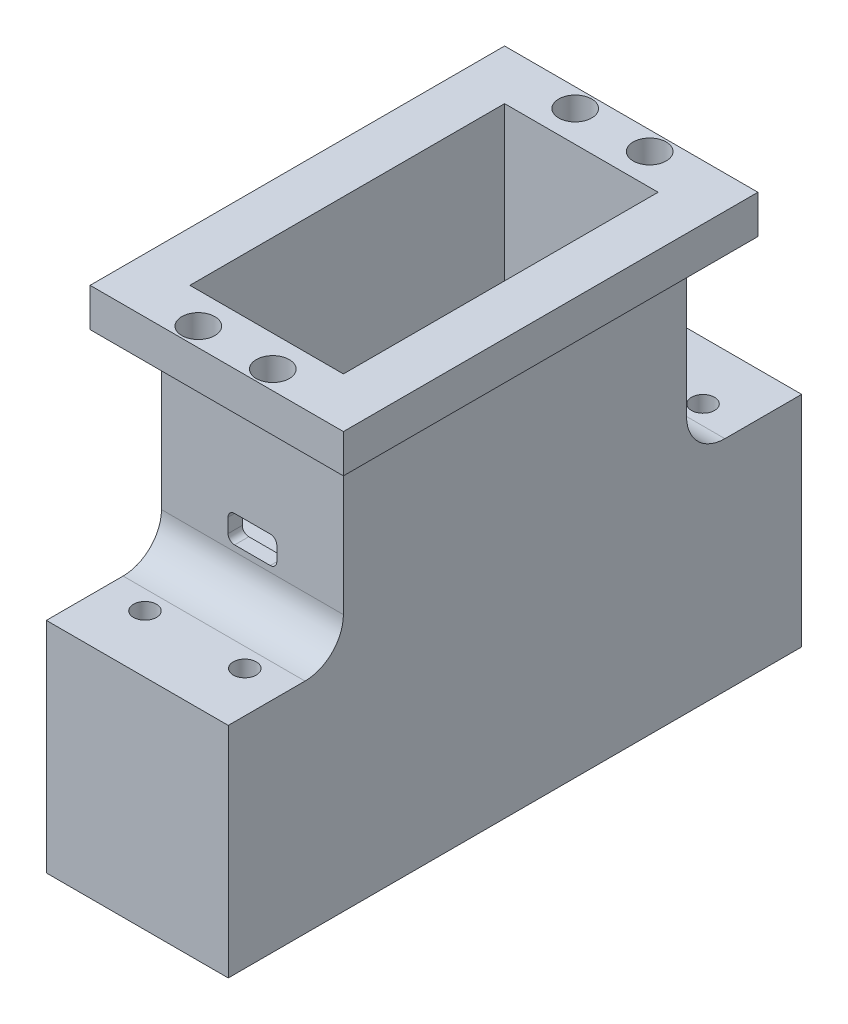
ISO-10303-21;
HEADER;
FILE_DESCRIPTION(('STEP AP214'),'2;1');
FILE_NAME('part.step','',(''),(''),'','','');
FILE_SCHEMA(('AUTOMOTIVE_DESIGN { 1 0 10303 214 1 1 1 1 }'));
ENDSEC;
DATA;
#1=APPLICATION_CONTEXT('core data for automotive mechanical design processes');
#2=APPLICATION_PROTOCOL_DEFINITION('international standard','automotive_design',2000,#1);
#3=PRODUCT_CONTEXT('',#1,'mechanical');
#4=PRODUCT('Part','Part','',(#3));
#5=PRODUCT_RELATED_PRODUCT_CATEGORY('part','',(#4));
#6=PRODUCT_DEFINITION_FORMATION('','',#4);
#7=PRODUCT_DEFINITION_CONTEXT('part definition',#1,'design');
#8=PRODUCT_DEFINITION('design','',#6,#7);
#9=PRODUCT_DEFINITION_SHAPE('','',#8);
#10=(LENGTH_UNIT() NAMED_UNIT(*) SI_UNIT(.MILLI.,.METRE.));
#11=(NAMED_UNIT(*) PLANE_ANGLE_UNIT() SI_UNIT($,.RADIAN.));
#12=(NAMED_UNIT(*) SI_UNIT($,.STERADIAN.) SOLID_ANGLE_UNIT());
#13=UNCERTAINTY_MEASURE_WITH_UNIT(LENGTH_MEASURE(1.E-05),#10,'distance_accuracy_value','');
#14=(GEOMETRIC_REPRESENTATION_CONTEXT(3) GLOBAL_UNCERTAINTY_ASSIGNED_CONTEXT((#13)) GLOBAL_UNIT_ASSIGNED_CONTEXT((#10,
#11,#12)) REPRESENTATION_CONTEXT('',''));
#15=CARTESIAN_POINT('',(0.,0.,0.));
#16=DIRECTION('',(0.,0.,1.));
#17=DIRECTION('',(1.,0.,0.));
#18=AXIS2_PLACEMENT_3D('',#15,#16,#17);
#19=CARTESIAN_POINT('',(0.,30.3,-20.5));
#20=DIRECTION('',(0.,0.,-1.));
#21=DIRECTION('',(-1.,0.,0.));
#22=AXIS2_PLACEMENT_3D('',#19,#20,#21);
#23=PLANE('',#22);
#24=DIRECTION('',(0.,-1.,0.));
#25=VECTOR('',#24,1.);
#26=CARTESIAN_POINT('',(-10.,30.3,-20.5));
#27=LINE('',#26,#25);
#28=CARTESIAN_POINT('',(-10.,30.3,-20.5));
#29=VERTEX_POINT('',#28);
#30=CARTESIAN_POINT('',(-10.,2.00000000000001,-20.5));
#31=VERTEX_POINT('',#30);
#32=EDGE_CURVE('E382',#29,#31,#27,.T.);
#33=ORIENTED_EDGE('',*,*,#32,.T.);
#34=DIRECTION('',(1.,0.,0.));
#35=VECTOR('',#34,1.);
#36=CARTESIAN_POINT('',(0.,2.,-20.5));
#37=LINE('',#36,#35);
#38=CARTESIAN_POINT('',(10.,2.00000000000001,-20.5));
#39=VERTEX_POINT('',#38);
#40=EDGE_CURVE('E362',#31,#39,#37,.T.);
#41=ORIENTED_EDGE('',*,*,#40,.T.);
#42=DIRECTION('',(0.,-1.,0.));
#43=VECTOR('',#42,1.);
#44=CARTESIAN_POINT('',(10.,30.3,-20.5));
#45=LINE('',#44,#43);
#46=CARTESIAN_POINT('',(10.,30.3,-20.5));
#47=VERTEX_POINT('',#46);
#48=EDGE_CURVE('E391',#47,#39,#45,.T.);
#49=ORIENTED_EDGE('',*,*,#48,.F.);
#50=DIRECTION('',(1.,0.,0.));
#51=VECTOR('',#50,1.);
#52=CARTESIAN_POINT('',(0.,30.3,-20.5));
#53=LINE('',#52,#51);
#54=EDGE_CURVE('E370',#29,#47,#53,.T.);
#55=ORIENTED_EDGE('',*,*,#54,.F.);
#56=EDGE_LOOP('',(#33,#41,#49,#55));
#57=FACE_BOUND('',#56,.T.);
#58=ADVANCED_FACE('F65',(#57),#23,.F.);
#59=CARTESIAN_POINT('',(10.,30.3,0.));
#60=DIRECTION('',(1.,0.,0.));
#61=DIRECTION('',(0.,0.,-1.));
#62=AXIS2_PLACEMENT_3D('',#59,#60,#61);
#63=PLANE('',#62);
#64=ORIENTED_EDGE('',*,*,#48,.T.);
#65=DIRECTION('',(0.,0.,1.));
#66=VECTOR('',#65,1.);
#67=CARTESIAN_POINT('',(10.,2.,0.));
#68=LINE('',#67,#66);
#69=CARTESIAN_POINT('',(10.,2.00000000000001,20.5));
#70=VERTEX_POINT('',#69);
#71=EDGE_CURVE('E354',#39,#70,#68,.T.);
#72=ORIENTED_EDGE('',*,*,#71,.T.);
#73=DIRECTION('',(0.,-1.,0.));
#74=VECTOR('',#73,1.);
#75=CARTESIAN_POINT('',(10.,30.3,20.5));
#76=LINE('',#75,#74);
#77=CARTESIAN_POINT('',(10.,30.3,20.5));
#78=VERTEX_POINT('',#77);
#79=EDGE_CURVE('E388',#78,#70,#76,.T.);
#80=ORIENTED_EDGE('',*,*,#79,.F.);
#81=DIRECTION('',(0.,0.,1.));
#82=VECTOR('',#81,1.);
#83=CARTESIAN_POINT('',(10.,30.3,0.));
#84=LINE('',#83,#82);
#85=EDGE_CURVE('E373',#47,#78,#84,.T.);
#86=ORIENTED_EDGE('',*,*,#85,.F.);
#87=EDGE_LOOP('',(#64,#72,#80,#86));
#88=FACE_BOUND('',#87,.T.);
#89=ADVANCED_FACE('F470',(#88),#63,.F.);
#90=CARTESIAN_POINT('',(0.,30.3,20.5));
#91=DIRECTION('',(0.,0.,-1.));
#92=DIRECTION('',(-1.,0.,0.));
#93=AXIS2_PLACEMENT_3D('',#90,#91,#92);
#94=PLANE('',#93);
#95=CARTESIAN_POINT('',(-2.32500000000009,8.47500000000009,20.5));
#96=DIRECTION('',(0.,0.,-1.));
#97=DIRECTION('',(-1.,0.,0.));
#98=AXIS2_PLACEMENT_3D('',#95,#96,#97);
#99=CIRCLE('',#98,0.849999999999906);
#100=CARTESIAN_POINT('',(-3.175,8.47500000000009,20.5));
#101=VERTEX_POINT('',#100);
#102=CARTESIAN_POINT('',(-2.32500000000009,9.325,20.5));
#103=VERTEX_POINT('',#102);
#104=EDGE_CURVE('E248',#101,#103,#99,.T.);
#105=ORIENTED_EDGE('',*,*,#104,.F.);
#106=DIRECTION('',(0.,1.,0.));
#107=VECTOR('',#106,1.);
#108=CARTESIAN_POINT('',(-3.175,30.3,20.5));
#109=LINE('',#108,#107);
#110=CARTESIAN_POINT('',(-3.175,6.62499999999991,20.5));
#111=VERTEX_POINT('',#110);
#112=EDGE_CURVE('E237',#111,#101,#109,.T.);
#113=ORIENTED_EDGE('',*,*,#112,.F.);
#114=CARTESIAN_POINT('',(-2.32500000000009,6.62499999999991,20.5));
#115=DIRECTION('',(0.,0.,-1.));
#116=DIRECTION('',(-1.,0.,0.));
#117=AXIS2_PLACEMENT_3D('',#114,#115,#116);
#118=CIRCLE('',#117,0.849999999999906);
#119=CARTESIAN_POINT('',(-2.32500000000009,5.775,20.5));
#120=VERTEX_POINT('',#119);
#121=EDGE_CURVE('E242',#120,#111,#118,.T.);
#122=ORIENTED_EDGE('',*,*,#121,.F.);
#123=DIRECTION('',(-1.,0.,0.));
#124=VECTOR('',#123,1.);
#125=CARTESIAN_POINT('',(0.,5.775,20.5));
#126=LINE('',#125,#124);
#127=CARTESIAN_POINT('',(2.32500000000009,5.775,20.5));
#128=VERTEX_POINT('',#127);
#129=EDGE_CURVE('E917',#128,#120,#126,.T.);
#130=ORIENTED_EDGE('',*,*,#129,.F.);
#131=CARTESIAN_POINT('',(2.32500000000009,6.62499999999991,20.5));
#132=DIRECTION('',(0.,0.,-1.));
#133=DIRECTION('',(-1.,0.,0.));
#134=AXIS2_PLACEMENT_3D('',#131,#132,#133);
#135=CIRCLE('',#134,0.849999999999906);
#136=CARTESIAN_POINT('',(3.175,6.62499999999991,20.5));
#137=VERTEX_POINT('',#136);
#138=EDGE_CURVE('E919',#137,#128,#135,.T.);
#139=ORIENTED_EDGE('',*,*,#138,.F.);
#140=DIRECTION('',(0.,-1.,0.));
#141=VECTOR('',#140,1.);
#142=CARTESIAN_POINT('',(3.175,30.3,20.5));
#143=LINE('',#142,#141);
#144=CARTESIAN_POINT('',(3.175,8.47500000000009,20.5));
#145=VERTEX_POINT('',#144);
#146=EDGE_CURVE('E921',#145,#137,#143,.T.);
#147=ORIENTED_EDGE('',*,*,#146,.F.);
#148=CARTESIAN_POINT('',(2.32500000000009,8.47500000000009,20.5));
#149=DIRECTION('',(0.,0.,-1.));
#150=DIRECTION('',(-1.,0.,0.));
#151=AXIS2_PLACEMENT_3D('',#148,#149,#150);
#152=CIRCLE('',#151,0.849999999999906);
#153=CARTESIAN_POINT('',(2.32500000000009,9.325,20.5));
#154=VERTEX_POINT('',#153);
#155=EDGE_CURVE('E262',#154,#145,#152,.T.);
#156=ORIENTED_EDGE('',*,*,#155,.F.);
#157=DIRECTION('',(1.,0.,0.));
#158=VECTOR('',#157,1.);
#159=CARTESIAN_POINT('',(0.,9.325,20.5));
#160=LINE('',#159,#158);
#161=EDGE_CURVE('E256',#103,#154,#160,.T.);
#162=ORIENTED_EDGE('',*,*,#161,.F.);
#163=EDGE_LOOP('',(#105,#113,#122,#130,#139,#147,#156,#162));
#164=FACE_BOUND('',#163,.T.);
#165=DIRECTION('',(1.,0.,0.));
#166=VECTOR('',#165,1.);
#167=CARTESIAN_POINT('',(0.,2.,20.5));
#168=LINE('',#167,#166);
#169=CARTESIAN_POINT('',(-10.,2.,20.5));
#170=VERTEX_POINT('',#169);
#171=EDGE_CURVE('E367',#170,#70,#168,.T.);
#172=ORIENTED_EDGE('',*,*,#171,.F.);
#173=DIRECTION('',(0.,-1.,0.));
#174=VECTOR('',#173,1.);
#175=CARTESIAN_POINT('',(-10.,30.3,20.5));
#176=LINE('',#175,#174);
#177=CARTESIAN_POINT('',(-10.,30.3,20.5));
#178=VERTEX_POINT('',#177);
#179=EDGE_CURVE('E385',#178,#170,#176,.T.);
#180=ORIENTED_EDGE('',*,*,#179,.F.);
#181=DIRECTION('',(1.,0.,0.));
#182=VECTOR('',#181,1.);
#183=CARTESIAN_POINT('',(0.,30.3,20.5));
#184=LINE('',#183,#182);
#185=EDGE_CURVE('E375',#178,#78,#184,.T.);
#186=ORIENTED_EDGE('',*,*,#185,.T.);
#187=ORIENTED_EDGE('',*,*,#79,.T.);
#188=EDGE_LOOP('',(#172,#180,#186,#187));
#189=FACE_BOUND('',#188,.T.);
#190=ADVANCED_FACE('F253',(#164,#189),#94,.T.);
#191=CARTESIAN_POINT('',(-10.,30.3,0.));
#192=DIRECTION('',(1.,0.,0.));
#193=DIRECTION('',(0.,0.,-1.));
#194=AXIS2_PLACEMENT_3D('',#191,#192,#193);
#195=PLANE('',#194);
#196=DIRECTION('',(0.,0.,1.));
#197=VECTOR('',#196,1.);
#198=CARTESIAN_POINT('',(-10.,2.,0.));
#199=LINE('',#198,#197);
#200=EDGE_CURVE('E364',#31,#170,#199,.T.);
#201=ORIENTED_EDGE('',*,*,#200,.F.);
#202=ORIENTED_EDGE('',*,*,#32,.F.);
#203=DIRECTION('',(0.,0.,1.));
#204=VECTOR('',#203,1.);
#205=CARTESIAN_POINT('',(-10.,30.3,0.));
#206=LINE('',#205,#204);
#207=EDGE_CURVE('E378',#29,#178,#206,.T.);
#208=ORIENTED_EDGE('',*,*,#207,.T.);
#209=ORIENTED_EDGE('',*,*,#179,.T.);
#210=EDGE_LOOP('',(#201,#202,#208,#209));
#211=FACE_BOUND('',#210,.T.);
#212=ADVANCED_FACE('F621',(#211),#195,.T.);
#213=CARTESIAN_POINT('',(0.,30.3,0.));
#214=DIRECTION('',(0.,1.,0.));
#215=DIRECTION('',(0.,0.,1.));
#216=AXIS2_PLACEMENT_3D('',#213,#214,#215);
#217=PLANE('',#216);
#218=CARTESIAN_POINT('',(4.84999999999999,30.3,-24.55));
#219=DIRECTION('',(0.,1.,0.));
#220=DIRECTION('',(0.,0.,-1.));
#221=AXIS2_PLACEMENT_3D('',#218,#219,#220);
#222=CIRCLE('',#221,2.15);
#223=CARTESIAN_POINT('',(4.84999999999999,30.3,-26.7));
#224=VERTEX_POINT('',#223);
#225=EDGE_CURVE('E893',#224,#224,#222,.T.);
#226=ORIENTED_EDGE('',*,*,#225,.F.);
#227=EDGE_LOOP('',(#226));
#228=FACE_BOUND('',#227,.T.);
#229=CARTESIAN_POINT('',(-4.85,30.3,24.55));
#230=DIRECTION('',(0.,1.,0.));
#231=DIRECTION('',(0.,0.,1.));
#232=AXIS2_PLACEMENT_3D('',#229,#230,#231);
#233=CIRCLE('',#232,2.15);
#234=CARTESIAN_POINT('',(-4.85,30.3,26.7));
#235=VERTEX_POINT('',#234);
#236=EDGE_CURVE('E890',#235,#235,#233,.T.);
#237=ORIENTED_EDGE('',*,*,#236,.F.);
#238=EDGE_LOOP('',(#237));
#239=FACE_BOUND('',#238,.T.);
#240=CARTESIAN_POINT('',(4.85000000000002,30.3,24.55));
#241=DIRECTION('',(0.,1.,0.));
#242=DIRECTION('',(0.,0.,-1.));
#243=AXIS2_PLACEMENT_3D('',#240,#241,#242);
#244=CIRCLE('',#243,2.15);
#245=CARTESIAN_POINT('',(4.85000000000002,30.3,22.4));
#246=VERTEX_POINT('',#245);
#247=EDGE_CURVE('E883',#246,#246,#244,.T.);
#248=ORIENTED_EDGE('',*,*,#247,.F.);
#249=EDGE_LOOP('',(#248));
#250=FACE_BOUND('',#249,.T.);
#251=CARTESIAN_POINT('',(-4.85,30.3,-24.55));
#252=DIRECTION('',(0.,1.,0.));
#253=DIRECTION('',(0.,0.,1.));
#254=AXIS2_PLACEMENT_3D('',#251,#252,#253);
#255=CIRCLE('',#254,2.15);
#256=CARTESIAN_POINT('',(-4.85,30.3,-22.4));
#257=VERTEX_POINT('',#256);
#258=EDGE_CURVE('E445',#257,#257,#255,.T.);
#259=ORIENTED_EDGE('',*,*,#258,.F.);
#260=EDGE_LOOP('',(#259));
#261=FACE_BOUND('',#260,.T.);
#262=ORIENTED_EDGE('',*,*,#54,.T.);
#263=ORIENTED_EDGE('',*,*,#85,.T.);
#264=ORIENTED_EDGE('',*,*,#185,.F.);
#265=ORIENTED_EDGE('',*,*,#207,.F.);
#266=EDGE_LOOP('',(#262,#263,#264,#265));
#267=FACE_BOUND('',#266,.T.);
#268=DIRECTION('',(0.,0.,-1.));
#269=VECTOR('',#268,1.);
#270=CARTESIAN_POINT('',(16.5,30.3,0.));
#271=LINE('',#270,#269);
#272=CARTESIAN_POINT('',(16.5,30.3,27.));
#273=VERTEX_POINT('',#272);
#274=CARTESIAN_POINT('',(16.5,30.3,-27.));
#275=VERTEX_POINT('',#274);
#276=EDGE_CURVE('E330',#273,#275,#271,.T.);
#277=ORIENTED_EDGE('',*,*,#276,.T.);
#278=DIRECTION('',(-1.,0.,0.));
#279=VECTOR('',#278,1.);
#280=CARTESIAN_POINT('',(0.,30.3,-27.));
#281=LINE('',#280,#279);
#282=CARTESIAN_POINT('',(-16.5,30.3,-27.));
#283=VERTEX_POINT('',#282);
#284=EDGE_CURVE('E345',#275,#283,#281,.T.);
#285=ORIENTED_EDGE('',*,*,#284,.T.);
#286=DIRECTION('',(0.,0.,-1.));
#287=VECTOR('',#286,1.);
#288=CARTESIAN_POINT('',(-16.5,30.3,0.));
#289=LINE('',#288,#287);
#290=CARTESIAN_POINT('',(-16.5,30.3,27.));
#291=VERTEX_POINT('',#290);
#292=EDGE_CURVE('E348',#291,#283,#289,.T.);
#293=ORIENTED_EDGE('',*,*,#292,.F.);
#294=DIRECTION('',(-1.,0.,0.));
#295=VECTOR('',#294,1.);
#296=CARTESIAN_POINT('',(0.,30.3,27.));
#297=LINE('',#296,#295);
#298=EDGE_CURVE('E335',#273,#291,#297,.T.);
#299=ORIENTED_EDGE('',*,*,#298,.F.);
#300=EDGE_LOOP('',(#277,#285,#293,#299));
#301=FACE_BOUND('',#300,.T.);
#302=ADVANCED_FACE('F617',(#228,#239,#250,#261,#267,#301),#217,.T.);
#303=CARTESIAN_POINT('',(0.,2.,0.));
#304=DIRECTION('',(0.,1.,0.));
#305=DIRECTION('',(0.,0.,1.));
#306=AXIS2_PLACEMENT_3D('',#303,#304,#305);
#307=PLANE('',#306);
#308=ORIENTED_EDGE('',*,*,#71,.F.);
#309=ORIENTED_EDGE('',*,*,#40,.F.);
#310=ORIENTED_EDGE('',*,*,#200,.T.);
#311=ORIENTED_EDGE('',*,*,#171,.T.);
#312=EDGE_LOOP('',(#308,#309,#310,#311));
#313=FACE_BOUND('',#312,.T.);
#314=ADVANCED_FACE('F613',(#313),#307,.T.);
#315=CARTESIAN_POINT('',(16.5,25.3,0.));
#316=DIRECTION('',(1.,0.,0.));
#317=DIRECTION('',(0.,0.,-1.));
#318=AXIS2_PLACEMENT_3D('',#315,#316,#317);
#319=PLANE('',#318);
#320=ORIENTED_EDGE('',*,*,#276,.F.);
#321=DIRECTION('',(0.,1.,0.));
#322=VECTOR('',#321,1.);
#323=CARTESIAN_POINT('',(16.5,25.3,27.));
#324=LINE('',#323,#322);
#325=CARTESIAN_POINT('',(16.5,25.3,27.));
#326=VERTEX_POINT('',#325);
#327=EDGE_CURVE('E352',#326,#273,#324,.T.);
#328=ORIENTED_EDGE('',*,*,#327,.F.);
#329=DIRECTION('',(0.,0.,-1.));
#330=VECTOR('',#329,1.);
#331=CARTESIAN_POINT('',(16.5,25.3,0.));
#332=LINE('',#331,#330);
#333=CARTESIAN_POINT('',(16.5,25.3,-27.));
#334=VERTEX_POINT('',#333);
#335=EDGE_CURVE('E331',#326,#334,#332,.T.);
#336=ORIENTED_EDGE('',*,*,#335,.T.);
#337=DIRECTION('',(0.,1.,0.));
#338=VECTOR('',#337,1.);
#339=CARTESIAN_POINT('',(16.5,25.3,-27.));
#340=LINE('',#339,#338);
#341=EDGE_CURVE('E342',#334,#275,#340,.T.);
#342=ORIENTED_EDGE('',*,*,#341,.T.);
#343=EDGE_LOOP('',(#320,#328,#336,#342));
#344=FACE_BOUND('',#343,.T.);
#345=ADVANCED_FACE('F603',(#344),#319,.T.);
#346=CARTESIAN_POINT('',(0.,25.3,27.));
#347=DIRECTION('',(0.,0.,-1.));
#348=DIRECTION('',(-1.,0.,0.));
#349=AXIS2_PLACEMENT_3D('',#346,#347,#348);
#350=PLANE('',#349);
#351=ORIENTED_EDGE('',*,*,#298,.T.);
#352=DIRECTION('',(0.,1.,0.));
#353=VECTOR('',#352,1.);
#354=CARTESIAN_POINT('',(-16.5,25.3,27.));
#355=LINE('',#354,#353);
#356=CARTESIAN_POINT('',(-16.5,25.3,27.));
#357=VERTEX_POINT('',#356);
#358=EDGE_CURVE('E355',#357,#291,#355,.T.);
#359=ORIENTED_EDGE('',*,*,#358,.F.);
#360=DIRECTION('',(-1.,0.,0.));
#361=VECTOR('',#360,1.);
#362=CARTESIAN_POINT('',(0.,25.3,27.));
#363=LINE('',#362,#361);
#364=EDGE_CURVE('E340',#326,#357,#363,.T.);
#365=ORIENTED_EDGE('',*,*,#364,.F.);
#366=ORIENTED_EDGE('',*,*,#327,.T.);
#367=EDGE_LOOP('',(#351,#359,#365,#366));
#368=FACE_BOUND('',#367,.T.);
#369=ADVANCED_FACE('F599',(#368),#350,.F.);
#370=CARTESIAN_POINT('',(-16.5,25.3,0.));
#371=DIRECTION('',(1.,0.,0.));
#372=DIRECTION('',(0.,0.,-1.));
#373=AXIS2_PLACEMENT_3D('',#370,#371,#372);
#374=PLANE('',#373);
#375=ORIENTED_EDGE('',*,*,#292,.T.);
#376=DIRECTION('',(0.,1.,0.));
#377=VECTOR('',#376,1.);
#378=CARTESIAN_POINT('',(-16.5,25.3,-27.));
#379=LINE('',#378,#377);
#380=CARTESIAN_POINT('',(-16.5,25.3,-27.));
#381=VERTEX_POINT('',#380);
#382=EDGE_CURVE('E358',#381,#283,#379,.T.);
#383=ORIENTED_EDGE('',*,*,#382,.F.);
#384=DIRECTION('',(0.,0.,-1.));
#385=VECTOR('',#384,1.);
#386=CARTESIAN_POINT('',(-16.5,25.3,0.));
#387=LINE('',#386,#385);
#388=EDGE_CURVE('E338',#357,#381,#387,.T.);
#389=ORIENTED_EDGE('',*,*,#388,.F.);
#390=ORIENTED_EDGE('',*,*,#358,.T.);
#391=EDGE_LOOP('',(#375,#383,#389,#390));
#392=FACE_BOUND('',#391,.T.);
#393=ADVANCED_FACE('F602',(#392),#374,.F.);
#394=CARTESIAN_POINT('',(0.,25.3,-27.));
#395=DIRECTION('',(0.,0.,-1.));
#396=DIRECTION('',(-1.,0.,0.));
#397=AXIS2_PLACEMENT_3D('',#394,#395,#396);
#398=PLANE('',#397);
#399=ORIENTED_EDGE('',*,*,#284,.F.);
#400=ORIENTED_EDGE('',*,*,#341,.F.);
#401=DIRECTION('',(-1.,0.,0.));
#402=VECTOR('',#401,1.);
#403=CARTESIAN_POINT('',(0.,25.3,-27.));
#404=LINE('',#403,#402);
#405=EDGE_CURVE('E334',#334,#381,#404,.T.);
#406=ORIENTED_EDGE('',*,*,#405,.T.);
#407=ORIENTED_EDGE('',*,*,#382,.T.);
#408=EDGE_LOOP('',(#399,#400,#406,#407));
#409=FACE_BOUND('',#408,.T.);
#410=ADVANCED_FACE('F598',(#409),#398,.T.);
#411=CARTESIAN_POINT('',(0.,25.3,0.));
#412=DIRECTION('',(0.,1.,0.));
#413=DIRECTION('',(0.,0.,1.));
#414=AXIS2_PLACEMENT_3D('',#411,#412,#413);
#415=PLANE('',#414);
#416=CARTESIAN_POINT('',(4.84999999999999,25.3,-24.55));
#417=DIRECTION('',(0.,1.,0.));
#418=DIRECTION('',(0.,0.,1.));
#419=AXIS2_PLACEMENT_3D('',#416,#417,#418);
#420=CIRCLE('',#419,2.15);
#421=CARTESIAN_POINT('',(4.84999999999999,25.3,-22.4));
#422=VERTEX_POINT('',#421);
#423=EDGE_CURVE('E69',#422,#422,#420,.T.);
#424=ORIENTED_EDGE('',*,*,#423,.T.);
#425=EDGE_LOOP('',(#424));
#426=FACE_BOUND('',#425,.T.);
#427=CARTESIAN_POINT('',(-4.85,25.3,24.55));
#428=DIRECTION('',(0.,1.,0.));
#429=DIRECTION('',(0.,0.,1.));
#430=AXIS2_PLACEMENT_3D('',#427,#428,#429);
#431=CIRCLE('',#430,2.15);
#432=CARTESIAN_POINT('',(-4.85,25.3,26.7));
#433=VERTEX_POINT('',#432);
#434=EDGE_CURVE('E447',#433,#433,#431,.T.);
#435=ORIENTED_EDGE('',*,*,#434,.T.);
#436=EDGE_LOOP('',(#435));
#437=FACE_BOUND('',#436,.T.);
#438=CARTESIAN_POINT('',(4.85000000000002,25.3,24.55));
#439=DIRECTION('',(0.,1.,0.));
#440=DIRECTION('',(0.,0.,1.));
#441=AXIS2_PLACEMENT_3D('',#438,#439,#440);
#442=CIRCLE('',#441,2.15);
#443=CARTESIAN_POINT('',(4.85000000000002,25.3,26.7));
#444=VERTEX_POINT('',#443);
#445=EDGE_CURVE('E444',#444,#444,#442,.T.);
#446=ORIENTED_EDGE('',*,*,#445,.T.);
#447=EDGE_LOOP('',(#446));
#448=FACE_BOUND('',#447,.T.);
#449=CARTESIAN_POINT('',(-4.85,25.3,-24.55));
#450=DIRECTION('',(0.,1.,0.));
#451=DIRECTION('',(0.,0.,1.));
#452=AXIS2_PLACEMENT_3D('',#449,#450,#451);
#453=CIRCLE('',#452,2.15);
#454=CARTESIAN_POINT('',(-4.85,25.3,-22.4));
#455=VERTEX_POINT('',#454);
#456=EDGE_CURVE('E441',#455,#455,#453,.T.);
#457=ORIENTED_EDGE('',*,*,#456,.T.);
#458=EDGE_LOOP('',(#457));
#459=FACE_BOUND('',#458,.T.);
#460=DIRECTION('',(-1.,0.,0.));
#461=VECTOR('',#460,1.);
#462=CARTESIAN_POINT('',(0.,25.3,22.35));
#463=LINE('',#462,#461);
#464=CARTESIAN_POINT('',(11.85,25.3,22.35));
#465=VERTEX_POINT('',#464);
#466=CARTESIAN_POINT('',(-11.85,25.3,22.35));
#467=VERTEX_POINT('',#466);
#468=EDGE_CURVE('E327',#465,#467,#463,.T.);
#469=ORIENTED_EDGE('',*,*,#468,.F.);
#470=DIRECTION('',(0.,0.,-1.));
#471=VECTOR('',#470,1.);
#472=CARTESIAN_POINT('',(11.85,25.3,0.));
#473=LINE('',#472,#471);
#474=CARTESIAN_POINT('',(11.85,25.3,-22.35));
#475=VERTEX_POINT('',#474);
#476=EDGE_CURVE('E320',#465,#475,#473,.T.);
#477=ORIENTED_EDGE('',*,*,#476,.T.);
#478=DIRECTION('',(-1.,0.,0.));
#479=VECTOR('',#478,1.);
#480=CARTESIAN_POINT('',(0.,25.3,-22.35));
#481=LINE('',#480,#479);
#482=CARTESIAN_POINT('',(-11.85,25.3,-22.35));
#483=VERTEX_POINT('',#482);
#484=EDGE_CURVE('E322',#475,#483,#481,.T.);
#485=ORIENTED_EDGE('',*,*,#484,.T.);
#486=DIRECTION('',(0.,0.,-1.));
#487=VECTOR('',#486,1.);
#488=CARTESIAN_POINT('',(-11.85,25.3,0.));
#489=LINE('',#488,#487);
#490=EDGE_CURVE('E324',#467,#483,#489,.T.);
#491=ORIENTED_EDGE('',*,*,#490,.F.);
#492=EDGE_LOOP('',(#469,#477,#485,#491));
#493=FACE_BOUND('',#492,.T.);
#494=ORIENTED_EDGE('',*,*,#335,.F.);
#495=ORIENTED_EDGE('',*,*,#364,.T.);
#496=ORIENTED_EDGE('',*,*,#388,.T.);
#497=ORIENTED_EDGE('',*,*,#405,.F.);
#498=EDGE_LOOP('',(#494,#495,#496,#497));
#499=FACE_BOUND('',#498,.T.);
#500=ADVANCED_FACE('F454',(#426,#437,#448,#459,#493,#499),#415,.F.);
#501=CARTESIAN_POINT('',(11.85,30.3,0.));
#502=DIRECTION('',(1.,0.,0.));
#503=DIRECTION('',(0.,0.,-1.));
#504=AXIS2_PLACEMENT_3D('',#501,#502,#503);
#505=PLANE('',#504);
#506=DIRECTION('',(0.,-1.,0.));
#507=VECTOR('',#506,1.);
#508=CARTESIAN_POINT('',(11.85,30.3,-22.35));
#509=LINE('',#508,#507);
#510=CARTESIAN_POINT('',(11.85,5.00000000000001,-22.35));
#511=VERTEX_POINT('',#510);
#512=EDGE_CURVE('E381',#475,#511,#509,.T.);
#513=ORIENTED_EDGE('',*,*,#512,.F.);
#514=ORIENTED_EDGE('',*,*,#476,.F.);
#515=DIRECTION('',(0.,-1.,0.));
#516=VECTOR('',#515,1.);
#517=CARTESIAN_POINT('',(11.85,30.3,22.35));
#518=LINE('',#517,#516);
#519=CARTESIAN_POINT('',(11.85,5.00000000000001,22.35));
#520=VERTEX_POINT('',#519);
#521=EDGE_CURVE('E397',#465,#520,#518,.T.);
#522=ORIENTED_EDGE('',*,*,#521,.T.);
#523=CARTESIAN_POINT('',(11.85,5.,27.35));
#524=DIRECTION('',(1.,0.,0.));
#525=DIRECTION('',(0.,0.,-1.));
#526=AXIS2_PLACEMENT_3D('',#523,#524,#525);
#527=CIRCLE('',#526,5.);
#528=CARTESIAN_POINT('',(11.85,0.,27.35));
#529=VERTEX_POINT('',#528);
#530=EDGE_CURVE('E414',#520,#529,#527,.F.);
#531=ORIENTED_EDGE('',*,*,#530,.T.);
#532=DIRECTION('',(0.,0.,1.));
#533=VECTOR('',#532,1.);
#534=CARTESIAN_POINT('',(11.85,0.,37.35));
#535=LINE('',#534,#533);
#536=CARTESIAN_POINT('',(11.85,0.,37.35));
#537=VERTEX_POINT('',#536);
#538=EDGE_CURVE('E306',#529,#537,#535,.T.);
#539=ORIENTED_EDGE('',*,*,#538,.T.);
#540=DIRECTION('',(0.,1.,0.));
#541=VECTOR('',#540,1.);
#542=CARTESIAN_POINT('',(11.85,-28.5,37.35));
#543=LINE('',#542,#541);
#544=CARTESIAN_POINT('',(11.85,-28.5,37.35));
#545=VERTEX_POINT('',#544);
#546=EDGE_CURVE('E297',#545,#537,#543,.T.);
#547=ORIENTED_EDGE('',*,*,#546,.F.);
#548=DIRECTION('',(0.,0.,1.));
#549=VECTOR('',#548,1.);
#550=CARTESIAN_POINT('',(11.85,-28.5,37.35));
#551=LINE('',#550,#549);
#552=CARTESIAN_POINT('',(11.85,-28.5,-37.35));
#553=VERTEX_POINT('',#552);
#554=EDGE_CURVE('E295',#553,#545,#551,.T.);
#555=ORIENTED_EDGE('',*,*,#554,.F.);
#556=DIRECTION('',(0.,1.,0.));
#557=VECTOR('',#556,1.);
#558=CARTESIAN_POINT('',(11.85,-28.5,-37.35));
#559=LINE('',#558,#557);
#560=CARTESIAN_POINT('',(11.85,0.,-37.35));
#561=VERTEX_POINT('',#560);
#562=EDGE_CURVE('E311',#553,#561,#559,.T.);
#563=ORIENTED_EDGE('',*,*,#562,.T.);
#564=CARTESIAN_POINT('',(11.85,0.,-27.35));
#565=VERTEX_POINT('',#564);
#566=EDGE_CURVE('E291',#561,#565,#535,.T.);
#567=ORIENTED_EDGE('',*,*,#566,.T.);
#568=CARTESIAN_POINT('',(11.85,5.,-27.35));
#569=DIRECTION('',(1.,0.,0.));
#570=DIRECTION('',(0.,0.,-1.));
#571=AXIS2_PLACEMENT_3D('',#568,#569,#570);
#572=CIRCLE('',#571,5.);
#573=EDGE_CURVE('E418',#565,#511,#572,.F.);
#574=ORIENTED_EDGE('',*,*,#573,.T.);
#575=EDGE_LOOP('',(#513,#514,#522,#531,#539,#547,#555,#563,#567,#574));
#576=FACE_BOUND('',#575,.T.);
#577=ADVANCED_FACE('F480',(#576),#505,.T.);
#578=CARTESIAN_POINT('',(0.,30.3,22.35));
#579=DIRECTION('',(0.,0.,-1.));
#580=DIRECTION('',(-1.,0.,0.));
#581=AXIS2_PLACEMENT_3D('',#578,#579,#580);
#582=PLANE('',#581);
#583=DIRECTION('',(0.,1.,0.));
#584=VECTOR('',#583,1.);
#585=CARTESIAN_POINT('',(-3.175,30.3,22.35));
#586=LINE('',#585,#584);
#587=CARTESIAN_POINT('',(-3.175,6.62499999999991,22.35));
#588=VERTEX_POINT('',#587);
#589=CARTESIAN_POINT('',(-3.175,8.47500000000009,22.35));
#590=VERTEX_POINT('',#589);
#591=EDGE_CURVE('E422',#588,#590,#586,.T.);
#592=ORIENTED_EDGE('',*,*,#591,.T.);
#593=CARTESIAN_POINT('',(-2.32500000000009,8.47500000000009,22.35));
#594=DIRECTION('',(0.,0.,-1.));
#595=DIRECTION('',(-1.,0.,0.));
#596=AXIS2_PLACEMENT_3D('',#593,#594,#595);
#597=CIRCLE('',#596,0.849999999999906);
#598=CARTESIAN_POINT('',(-2.32500000000009,9.325,22.35));
#599=VERTEX_POINT('',#598);
#600=EDGE_CURVE('E12',#590,#599,#597,.T.);
#601=ORIENTED_EDGE('',*,*,#600,.T.);
#602=DIRECTION('',(1.,0.,0.));
#603=VECTOR('',#602,1.);
#604=CARTESIAN_POINT('',(0.,9.325,22.35));
#605=LINE('',#604,#603);
#606=CARTESIAN_POINT('',(2.32500000000009,9.325,22.35));
#607=VERTEX_POINT('',#606);
#608=EDGE_CURVE('E74',#599,#607,#605,.T.);
#609=ORIENTED_EDGE('',*,*,#608,.T.);
#610=CARTESIAN_POINT('',(2.32500000000009,8.47500000000009,22.35));
#611=DIRECTION('',(0.,0.,-1.));
#612=DIRECTION('',(-1.,0.,0.));
#613=AXIS2_PLACEMENT_3D('',#610,#611,#612);
#614=CIRCLE('',#613,0.849999999999906);
#615=CARTESIAN_POINT('',(3.175,8.47500000000009,22.35));
#616=VERTEX_POINT('',#615);
#617=EDGE_CURVE('E436',#607,#616,#614,.T.);
#618=ORIENTED_EDGE('',*,*,#617,.T.);
#619=DIRECTION('',(0.,-1.,0.));
#620=VECTOR('',#619,1.);
#621=CARTESIAN_POINT('',(3.175,30.3,22.35));
#622=LINE('',#621,#620);
#623=CARTESIAN_POINT('',(3.175,6.62499999999991,22.35));
#624=VERTEX_POINT('',#623);
#625=EDGE_CURVE('E433',#616,#624,#622,.T.);
#626=ORIENTED_EDGE('',*,*,#625,.T.);
#627=CARTESIAN_POINT('',(2.32500000000009,6.62499999999991,22.35));
#628=DIRECTION('',(0.,0.,-1.));
#629=DIRECTION('',(-1.,0.,0.));
#630=AXIS2_PLACEMENT_3D('',#627,#628,#629);
#631=CIRCLE('',#630,0.849999999999906);
#632=CARTESIAN_POINT('',(2.32500000000009,5.775,22.35));
#633=VERTEX_POINT('',#632);
#634=EDGE_CURVE('E430',#624,#633,#631,.T.);
#635=ORIENTED_EDGE('',*,*,#634,.T.);
#636=DIRECTION('',(-1.,0.,0.));
#637=VECTOR('',#636,1.);
#638=CARTESIAN_POINT('',(0.,5.775,22.35));
#639=LINE('',#638,#637);
#640=CARTESIAN_POINT('',(-2.32500000000009,5.775,22.35));
#641=VERTEX_POINT('',#640);
#642=EDGE_CURVE('E427',#633,#641,#639,.T.);
#643=ORIENTED_EDGE('',*,*,#642,.T.);
#644=CARTESIAN_POINT('',(-2.32500000000009,6.62499999999991,22.35));
#645=DIRECTION('',(0.,0.,-1.));
#646=DIRECTION('',(-1.,0.,0.));
#647=AXIS2_PLACEMENT_3D('',#644,#645,#646);
#648=CIRCLE('',#647,0.849999999999906);
#649=EDGE_CURVE('E424',#641,#588,#648,.T.);
#650=ORIENTED_EDGE('',*,*,#649,.T.);
#651=EDGE_LOOP('',(#592,#601,#609,#618,#626,#635,#643,#650));
#652=FACE_BOUND('',#651,.T.);
#653=DIRECTION('',(0.,-1.,0.));
#654=VECTOR('',#653,1.);
#655=CARTESIAN_POINT('',(-11.85,30.3,22.35));
#656=LINE('',#655,#654);
#657=CARTESIAN_POINT('',(-11.85,5.00000000000001,22.35));
#658=VERTEX_POINT('',#657);
#659=EDGE_CURVE('E400',#467,#658,#656,.T.);
#660=ORIENTED_EDGE('',*,*,#659,.T.);
#661=DIRECTION('',(1.,0.,0.));
#662=VECTOR('',#661,1.);
#663=CARTESIAN_POINT('',(0.,5.,22.35));
#664=LINE('',#663,#662);
#665=EDGE_CURVE('E394',#658,#520,#664,.T.);
#666=ORIENTED_EDGE('',*,*,#665,.T.);
#667=ORIENTED_EDGE('',*,*,#521,.F.);
#668=ORIENTED_EDGE('',*,*,#468,.T.);
#669=EDGE_LOOP('',(#660,#666,#667,#668));
#670=FACE_BOUND('',#669,.T.);
#671=ADVANCED_FACE('F483',(#652,#670),#582,.F.);
#672=CARTESIAN_POINT('',(-11.85,30.3,0.));
#673=DIRECTION('',(1.,0.,0.));
#674=DIRECTION('',(0.,0.,-1.));
#675=AXIS2_PLACEMENT_3D('',#672,#673,#674);
#676=PLANE('',#675);
#677=ORIENTED_EDGE('',*,*,#490,.T.);
#678=DIRECTION('',(0.,-1.,0.));
#679=VECTOR('',#678,1.);
#680=CARTESIAN_POINT('',(-11.85,30.3,-22.35));
#681=LINE('',#680,#679);
#682=CARTESIAN_POINT('',(-11.85,5.00000000000001,-22.35));
#683=VERTEX_POINT('',#682);
#684=EDGE_CURVE('E386',#483,#683,#681,.T.);
#685=ORIENTED_EDGE('',*,*,#684,.T.);
#686=CARTESIAN_POINT('',(-11.85,5.,-27.35));
#687=DIRECTION('',(1.,0.,0.));
#688=DIRECTION('',(0.,0.,-1.));
#689=AXIS2_PLACEMENT_3D('',#686,#687,#688);
#690=CIRCLE('',#689,5.);
#691=CARTESIAN_POINT('',(-11.85,0.,-27.35));
#692=VERTEX_POINT('',#691);
#693=EDGE_CURVE('E420',#683,#692,#690,.T.);
#694=ORIENTED_EDGE('',*,*,#693,.T.);
#695=DIRECTION('',(0.,0.,-1.));
#696=VECTOR('',#695,1.);
#697=CARTESIAN_POINT('',(-11.85,0.,-37.35));
#698=LINE('',#697,#696);
#699=CARTESIAN_POINT('',(-11.85,0.,-37.35));
#700=VERTEX_POINT('',#699);
#701=EDGE_CURVE('E300',#692,#700,#698,.T.);
#702=ORIENTED_EDGE('',*,*,#701,.T.);
#703=DIRECTION('',(0.,1.,0.));
#704=VECTOR('',#703,1.);
#705=CARTESIAN_POINT('',(-11.85,-28.5,-37.35));
#706=LINE('',#705,#704);
#707=CARTESIAN_POINT('',(-11.85,-28.5,-37.35));
#708=VERTEX_POINT('',#707);
#709=EDGE_CURVE('E314',#708,#700,#706,.T.);
#710=ORIENTED_EDGE('',*,*,#709,.F.);
#711=DIRECTION('',(0.,0.,-1.));
#712=VECTOR('',#711,1.);
#713=CARTESIAN_POINT('',(-11.85,-28.5,-37.35));
#714=LINE('',#713,#712);
#715=CARTESIAN_POINT('',(-11.85,-28.5,37.35));
#716=VERTEX_POINT('',#715);
#717=EDGE_CURVE('E290',#716,#708,#714,.T.);
#718=ORIENTED_EDGE('',*,*,#717,.F.);
#719=DIRECTION('',(0.,1.,0.));
#720=VECTOR('',#719,1.);
#721=CARTESIAN_POINT('',(-11.85,-28.5,37.35));
#722=LINE('',#721,#720);
#723=CARTESIAN_POINT('',(-11.85,0.,37.35));
#724=VERTEX_POINT('',#723);
#725=EDGE_CURVE('E317',#716,#724,#722,.T.);
#726=ORIENTED_EDGE('',*,*,#725,.T.);
#727=CARTESIAN_POINT('',(-11.85,0.,27.35));
#728=VERTEX_POINT('',#727);
#729=EDGE_CURVE('E301',#724,#728,#698,.T.);
#730=ORIENTED_EDGE('',*,*,#729,.T.);
#731=CARTESIAN_POINT('',(-11.85,5.,27.35));
#732=DIRECTION('',(1.,0.,0.));
#733=DIRECTION('',(0.,0.,-1.));
#734=AXIS2_PLACEMENT_3D('',#731,#732,#733);
#735=CIRCLE('',#734,5.);
#736=EDGE_CURVE('E416',#728,#658,#735,.T.);
#737=ORIENTED_EDGE('',*,*,#736,.T.);
#738=ORIENTED_EDGE('',*,*,#659,.F.);
#739=EDGE_LOOP('',(#677,#685,#694,#702,#710,#718,#726,#730,#737,#738));
#740=FACE_BOUND('',#739,.T.);
#741=ADVANCED_FACE('F487',(#740),#676,.F.);
#742=CARTESIAN_POINT('',(0.,30.3,-22.35));
#743=DIRECTION('',(0.,0.,-1.));
#744=DIRECTION('',(-1.,0.,0.));
#745=AXIS2_PLACEMENT_3D('',#742,#743,#744);
#746=PLANE('',#745);
#747=ORIENTED_EDGE('',*,*,#512,.T.);
#748=DIRECTION('',(1.,0.,0.));
#749=VECTOR('',#748,1.);
#750=CARTESIAN_POINT('',(-11.85,5.,-22.35));
#751=LINE('',#750,#749);
#752=EDGE_CURVE('E412',#511,#683,#751,.F.);
#753=ORIENTED_EDGE('',*,*,#752,.T.);
#754=ORIENTED_EDGE('',*,*,#684,.F.);
#755=ORIENTED_EDGE('',*,*,#484,.F.);
#756=EDGE_LOOP('',(#747,#753,#754,#755));
#757=FACE_BOUND('',#756,.T.);
#758=ADVANCED_FACE('F491',(#757),#746,.T.);
#759=CARTESIAN_POINT('',(0.,0.,0.));
#760=DIRECTION('',(0.,1.,0.));
#761=DIRECTION('',(0.,0.,1.));
#762=AXIS2_PLACEMENT_3D('',#759,#760,#761);
#763=PLANE('',#762);
#764=CARTESIAN_POINT('',(6.5,0.,29.85));
#765=DIRECTION('',(0.,-1.,0.));
#766=DIRECTION('',(0.,0.,-1.));
#767=AXIS2_PLACEMENT_3D('',#764,#765,#766);
#768=CIRCLE('',#767,1.5);
#769=CARTESIAN_POINT('',(6.5,0.,28.35));
#770=VERTEX_POINT('',#769);
#771=EDGE_CURVE('E272',#770,#770,#768,.T.);
#772=ORIENTED_EDGE('',*,*,#771,.T.);
#773=EDGE_LOOP('',(#772));
#774=FACE_BOUND('',#773,.T.);
#775=CARTESIAN_POINT('',(-6.5,0.,29.85));
#776=DIRECTION('',(0.,-1.,0.));
#777=DIRECTION('',(0.,0.,-1.));
#778=AXIS2_PLACEMENT_3D('',#775,#776,#777);
#779=CIRCLE('',#778,1.5);
#780=CARTESIAN_POINT('',(-6.5,0.,28.35));
#781=VERTEX_POINT('',#780);
#782=EDGE_CURVE('E278',#781,#781,#779,.T.);
#783=ORIENTED_EDGE('',*,*,#782,.T.);
#784=EDGE_LOOP('',(#783));
#785=FACE_BOUND('',#784,.T.);
#786=ORIENTED_EDGE('',*,*,#538,.F.);
#787=DIRECTION('',(1.,0.,0.));
#788=VECTOR('',#787,1.);
#789=CARTESIAN_POINT('',(0.,0.,27.35));
#790=LINE('',#789,#788);
#791=EDGE_CURVE('E407',#529,#728,#790,.F.);
#792=ORIENTED_EDGE('',*,*,#791,.T.);
#793=ORIENTED_EDGE('',*,*,#729,.F.);
#794=DIRECTION('',(-1.,0.,0.));
#795=VECTOR('',#794,1.);
#796=CARTESIAN_POINT('',(-11.85,0.,37.35));
#797=LINE('',#796,#795);
#798=EDGE_CURVE('E284',#537,#724,#797,.T.);
#799=ORIENTED_EDGE('',*,*,#798,.F.);
#800=EDGE_LOOP('',(#786,#792,#793,#799));
#801=FACE_BOUND('',#800,.T.);
#802=ADVANCED_FACE('F494',(#774,#785,#801),#763,.T.);
#803=CARTESIAN_POINT('',(0.,-28.5,0.));
#804=DIRECTION('',(0.,1.,0.));
#805=DIRECTION('',(0.,0.,1.));
#806=AXIS2_PLACEMENT_3D('',#803,#804,#805);
#807=PLANE('',#806);
#808=DIRECTION('',(-1.,0.,0.));
#809=VECTOR('',#808,1.);
#810=CARTESIAN_POINT('',(-11.85,-28.5,37.35));
#811=LINE('',#810,#809);
#812=EDGE_CURVE('E287',#545,#716,#811,.T.);
#813=ORIENTED_EDGE('',*,*,#812,.T.);
#814=ORIENTED_EDGE('',*,*,#717,.T.);
#815=DIRECTION('',(1.,0.,0.));
#816=VECTOR('',#815,1.);
#817=CARTESIAN_POINT('',(-11.85,-28.5,-37.35));
#818=LINE('',#817,#816);
#819=EDGE_CURVE('E293',#708,#553,#818,.T.);
#820=ORIENTED_EDGE('',*,*,#819,.T.);
#821=ORIENTED_EDGE('',*,*,#554,.T.);
#822=EDGE_LOOP('',(#813,#814,#820,#821));
#823=FACE_BOUND('',#822,.T.);
#824=CARTESIAN_POINT('',(-6.5,-28.5,29.85));
#825=DIRECTION('',(0.,-1.,0.));
#826=DIRECTION('',(0.,0.,-1.));
#827=AXIS2_PLACEMENT_3D('',#824,#825,#826);
#828=CIRCLE('',#827,1.5);
#829=CARTESIAN_POINT('',(-6.5,-28.5,28.35));
#830=VERTEX_POINT('',#829);
#831=EDGE_CURVE('E281',#830,#830,#828,.T.);
#832=ORIENTED_EDGE('',*,*,#831,.F.);
#833=EDGE_LOOP('',(#832));
#834=FACE_BOUND('',#833,.T.);
#835=CARTESIAN_POINT('',(6.5,-28.5,29.85));
#836=DIRECTION('',(0.,-1.,0.));
#837=DIRECTION('',(0.,0.,-1.));
#838=AXIS2_PLACEMENT_3D('',#835,#836,#837);
#839=CIRCLE('',#838,1.5);
#840=CARTESIAN_POINT('',(6.5,-28.5,28.35));
#841=VERTEX_POINT('',#840);
#842=EDGE_CURVE('E275',#841,#841,#839,.T.);
#843=ORIENTED_EDGE('',*,*,#842,.F.);
#844=EDGE_LOOP('',(#843));
#845=FACE_BOUND('',#844,.T.);
#846=CARTESIAN_POINT('',(6.5,-28.5,-29.85));
#847=DIRECTION('',(0.,-1.,0.));
#848=DIRECTION('',(0.,0.,1.));
#849=AXIS2_PLACEMENT_3D('',#846,#847,#848);
#850=CIRCLE('',#849,1.5);
#851=CARTESIAN_POINT('',(6.5,-28.5,-28.35));
#852=VERTEX_POINT('',#851);
#853=EDGE_CURVE('E269',#852,#852,#850,.T.);
#854=ORIENTED_EDGE('',*,*,#853,.F.);
#855=EDGE_LOOP('',(#854));
#856=FACE_BOUND('',#855,.T.);
#857=CARTESIAN_POINT('',(-6.5,-28.5,-29.85));
#858=DIRECTION('',(0.,-1.,0.));
#859=DIRECTION('',(0.,0.,1.));
#860=AXIS2_PLACEMENT_3D('',#857,#858,#859);
#861=CIRCLE('',#860,1.5);
#862=CARTESIAN_POINT('',(-6.5,-28.5,-28.35));
#863=VERTEX_POINT('',#862);
#864=EDGE_CURVE('E260',#863,#863,#861,.T.);
#865=ORIENTED_EDGE('',*,*,#864,.F.);
#866=EDGE_LOOP('',(#865));
#867=FACE_BOUND('',#866,.T.);
#868=ADVANCED_FACE('F539',(#823,#834,#845,#856,#867),#807,.F.);
#869=CARTESIAN_POINT('',(6.5,0.,-29.85));
#870=DIRECTION('',(0.,-1.,0.));
#871=DIRECTION('',(0.,0.,1.));
#872=AXIS2_PLACEMENT_3D('',#869,#870,#871);
#873=CIRCLE('',#872,1.5);
#874=CARTESIAN_POINT('',(6.5,0.,-28.35));
#875=VERTEX_POINT('',#874);
#876=EDGE_CURVE('E267',#875,#875,#873,.T.);
#877=ORIENTED_EDGE('',*,*,#876,.T.);
#878=EDGE_LOOP('',(#877));
#879=FACE_BOUND('',#878,.T.);
#880=ORIENTED_EDGE('',*,*,#701,.F.);
#881=DIRECTION('',(1.,0.,0.));
#882=VECTOR('',#881,1.);
#883=CARTESIAN_POINT('',(11.85,0.,-27.35));
#884=LINE('',#883,#882);
#885=EDGE_CURVE('E409',#692,#565,#884,.T.);
#886=ORIENTED_EDGE('',*,*,#885,.T.);
#887=ORIENTED_EDGE('',*,*,#566,.F.);
#888=DIRECTION('',(1.,0.,0.));
#889=VECTOR('',#888,1.);
#890=CARTESIAN_POINT('',(-11.85,0.,-37.35));
#891=LINE('',#890,#889);
#892=EDGE_CURVE('E304',#700,#561,#891,.T.);
#893=ORIENTED_EDGE('',*,*,#892,.F.);
#894=EDGE_LOOP('',(#880,#886,#887,#893));
#895=FACE_BOUND('',#894,.T.);
#896=CARTESIAN_POINT('',(-6.5,0.,-29.85));
#897=DIRECTION('',(0.,-1.,0.));
#898=DIRECTION('',(0.,0.,1.));
#899=AXIS2_PLACEMENT_3D('',#896,#897,#898);
#900=CIRCLE('',#899,1.5);
#901=CARTESIAN_POINT('',(-6.5,0.,-28.35));
#902=VERTEX_POINT('',#901);
#903=EDGE_CURVE('E257',#902,#902,#900,.T.);
#904=ORIENTED_EDGE('',*,*,#903,.T.);
#905=EDGE_LOOP('',(#904));
#906=FACE_BOUND('',#905,.T.);
#907=ADVANCED_FACE('F528',(#879,#895,#906),#763,.T.);
#908=CARTESIAN_POINT('',(-11.85,-28.5,37.35));
#909=DIRECTION('',(0.,0.,-1.));
#910=DIRECTION('',(-1.,0.,0.));
#911=AXIS2_PLACEMENT_3D('',#908,#909,#910);
#912=PLANE('',#911);
#913=ORIENTED_EDGE('',*,*,#798,.T.);
#914=ORIENTED_EDGE('',*,*,#725,.F.);
#915=ORIENTED_EDGE('',*,*,#812,.F.);
#916=ORIENTED_EDGE('',*,*,#546,.T.);
#917=EDGE_LOOP('',(#913,#914,#915,#916));
#918=FACE_BOUND('',#917,.T.);
#919=ADVANCED_FACE('F544',(#918),#912,.F.);
#920=CARTESIAN_POINT('',(-11.85,-28.5,-37.35));
#921=DIRECTION('',(0.,0.,1.));
#922=DIRECTION('',(1.,0.,0.));
#923=AXIS2_PLACEMENT_3D('',#920,#921,#922);
#924=PLANE('',#923);
#925=ORIENTED_EDGE('',*,*,#892,.T.);
#926=ORIENTED_EDGE('',*,*,#562,.F.);
#927=ORIENTED_EDGE('',*,*,#819,.F.);
#928=ORIENTED_EDGE('',*,*,#709,.T.);
#929=EDGE_LOOP('',(#925,#926,#927,#928));
#930=FACE_BOUND('',#929,.T.);
#931=ADVANCED_FACE('F533',(#930),#924,.F.);
#932=CARTESIAN_POINT('',(-6.5,-28.5,29.85));
#933=DIRECTION('',(0.,1.,0.));
#934=DIRECTION('',(0.,0.,1.));
#935=AXIS2_PLACEMENT_3D('',#932,#933,#934);
#936=CYLINDRICAL_SURFACE('',#935,1.5);
#937=ORIENTED_EDGE('',*,*,#831,.T.);
#938=EDGE_LOOP('',(#937));
#939=FACE_BOUND('',#938,.T.);
#940=ORIENTED_EDGE('',*,*,#782,.F.);
#941=EDGE_LOOP('',(#940));
#942=FACE_BOUND('',#941,.T.);
#943=ADVANCED_FACE('F570',(#939,#942),#936,.F.);
#944=CARTESIAN_POINT('',(6.5,-28.5,29.85));
#945=DIRECTION('',(0.,1.,0.));
#946=DIRECTION('',(0.,0.,1.));
#947=AXIS2_PLACEMENT_3D('',#944,#945,#946);
#948=CYLINDRICAL_SURFACE('',#947,1.5);
#949=ORIENTED_EDGE('',*,*,#842,.T.);
#950=EDGE_LOOP('',(#949));
#951=FACE_BOUND('',#950,.T.);
#952=ORIENTED_EDGE('',*,*,#771,.F.);
#953=EDGE_LOOP('',(#952));
#954=FACE_BOUND('',#953,.T.);
#955=ADVANCED_FACE('F564',(#951,#954),#948,.F.);
#956=CARTESIAN_POINT('',(6.5,-28.5,-29.85));
#957=DIRECTION('',(0.,1.,0.));
#958=DIRECTION('',(0.,0.,1.));
#959=AXIS2_PLACEMENT_3D('',#956,#957,#958);
#960=CYLINDRICAL_SURFACE('',#959,1.5);
#961=ORIENTED_EDGE('',*,*,#853,.T.);
#962=EDGE_LOOP('',(#961));
#963=FACE_BOUND('',#962,.T.);
#964=ORIENTED_EDGE('',*,*,#876,.F.);
#965=EDGE_LOOP('',(#964));
#966=FACE_BOUND('',#965,.T.);
#967=ADVANCED_FACE('F506',(#963,#966),#960,.F.);
#968=CARTESIAN_POINT('',(-6.5,-28.5,-29.85));
#969=DIRECTION('',(0.,1.,0.));
#970=DIRECTION('',(0.,0.,1.));
#971=AXIS2_PLACEMENT_3D('',#968,#969,#970);
#972=CYLINDRICAL_SURFACE('',#971,1.5);
#973=ORIENTED_EDGE('',*,*,#864,.T.);
#974=EDGE_LOOP('',(#973));
#975=FACE_BOUND('',#974,.T.);
#976=ORIENTED_EDGE('',*,*,#903,.F.);
#977=EDGE_LOOP('',(#976));
#978=FACE_BOUND('',#977,.T.);
#979=ADVANCED_FACE('F498',(#975,#978),#972,.F.);
#980=CARTESIAN_POINT('',(0.,5.,27.35));
#981=DIRECTION('',(1.,0.,0.));
#982=DIRECTION('',(0.,0.,-1.));
#983=AXIS2_PLACEMENT_3D('',#980,#981,#982);
#984=CYLINDRICAL_SURFACE('',#983,5.);
#985=ORIENTED_EDGE('',*,*,#736,.F.);
#986=ORIENTED_EDGE('',*,*,#791,.F.);
#987=ORIENTED_EDGE('',*,*,#530,.F.);
#988=ORIENTED_EDGE('',*,*,#665,.F.);
#989=EDGE_LOOP('',(#985,#986,#987,#988));
#990=FACE_BOUND('',#989,.T.);
#991=ADVANCED_FACE('F496',(#990),#984,.F.);
#992=CARTESIAN_POINT('',(0.,5.,-27.35));
#993=DIRECTION('',(-1.,0.,0.));
#994=DIRECTION('',(0.,0.,1.));
#995=AXIS2_PLACEMENT_3D('',#992,#993,#994);
#996=CYLINDRICAL_SURFACE('',#995,5.);
#997=ORIENTED_EDGE('',*,*,#693,.F.);
#998=ORIENTED_EDGE('',*,*,#752,.F.);
#999=ORIENTED_EDGE('',*,*,#573,.F.);
#1000=ORIENTED_EDGE('',*,*,#885,.F.);
#1001=EDGE_LOOP('',(#997,#998,#999,#1000));
#1002=FACE_BOUND('',#1001,.T.);
#1003=ADVANCED_FACE('F67',(#1002),#996,.F.);
#1004=CARTESIAN_POINT('',(-2.32500000000009,8.47500000000009,17.35));
#1005=DIRECTION('',(0.,0.,1.));
#1006=DIRECTION('',(1.,0.,0.));
#1007=AXIS2_PLACEMENT_3D('',#1004,#1005,#1006);
#1008=CYLINDRICAL_SURFACE('',#1007,0.849999999999906);
#1009=ORIENTED_EDGE('',*,*,#104,.T.);
#1010=DIRECTION('',(0.,0.,1.));
#1011=VECTOR('',#1010,1.);
#1012=CARTESIAN_POINT('',(-2.32500000000009,9.325,17.35));
#1013=LINE('',#1012,#1011);
#1014=EDGE_CURVE('E243',#103,#599,#1013,.T.);
#1015=ORIENTED_EDGE('',*,*,#1014,.T.);
#1016=ORIENTED_EDGE('',*,*,#600,.F.);
#1017=DIRECTION('',(0.,0.,1.));
#1018=VECTOR('',#1017,1.);
#1019=CARTESIAN_POINT('',(-3.175,8.47500000000009,17.35));
#1020=LINE('',#1019,#1018);
#1021=EDGE_CURVE('E87',#101,#590,#1020,.T.);
#1022=ORIENTED_EDGE('',*,*,#1021,.F.);
#1023=EDGE_LOOP('',(#1009,#1015,#1016,#1022));
#1024=FACE_BOUND('',#1023,.T.);
#1025=ADVANCED_FACE('F246',(#1024),#1008,.F.);
#1026=CARTESIAN_POINT('',(-2.32500000000009,9.325,17.35));
#1027=DIRECTION('',(0.,1.,0.));
#1028=DIRECTION('',(0.,0.,1.));
#1029=AXIS2_PLACEMENT_3D('',#1026,#1027,#1028);
#1030=PLANE('',#1029);
#1031=ORIENTED_EDGE('',*,*,#161,.T.);
#1032=DIRECTION('',(0.,0.,1.));
#1033=VECTOR('',#1032,1.);
#1034=CARTESIAN_POINT('',(2.32500000000009,9.325,17.35));
#1035=LINE('',#1034,#1033);
#1036=EDGE_CURVE('E900',#154,#607,#1035,.T.);
#1037=ORIENTED_EDGE('',*,*,#1036,.T.);
#1038=ORIENTED_EDGE('',*,*,#608,.F.);
#1039=ORIENTED_EDGE('',*,*,#1014,.F.);
#1040=EDGE_LOOP('',(#1031,#1037,#1038,#1039));
#1041=FACE_BOUND('',#1040,.T.);
#1042=ADVANCED_FACE('F645',(#1041),#1030,.F.);
#1043=CARTESIAN_POINT('',(2.32500000000009,8.47500000000009,17.35));
#1044=DIRECTION('',(0.,0.,1.));
#1045=DIRECTION('',(1.,0.,0.));
#1046=AXIS2_PLACEMENT_3D('',#1043,#1044,#1045);
#1047=CYLINDRICAL_SURFACE('',#1046,0.849999999999906);
#1048=ORIENTED_EDGE('',*,*,#155,.T.);
#1049=DIRECTION('',(0.,0.,1.));
#1050=VECTOR('',#1049,1.);
#1051=CARTESIAN_POINT('',(3.175,8.47500000000009,17.35));
#1052=LINE('',#1051,#1050);
#1053=EDGE_CURVE('E903',#145,#616,#1052,.T.);
#1054=ORIENTED_EDGE('',*,*,#1053,.T.);
#1055=ORIENTED_EDGE('',*,*,#617,.F.);
#1056=ORIENTED_EDGE('',*,*,#1036,.F.);
#1057=EDGE_LOOP('',(#1048,#1054,#1055,#1056));
#1058=FACE_BOUND('',#1057,.T.);
#1059=ADVANCED_FACE('F652',(#1058),#1047,.F.);
#1060=CARTESIAN_POINT('',(3.175,8.47500000000009,17.35));
#1061=DIRECTION('',(1.,0.,0.));
#1062=DIRECTION('',(0.,0.,-1.));
#1063=AXIS2_PLACEMENT_3D('',#1060,#1061,#1062);
#1064=PLANE('',#1063);
#1065=ORIENTED_EDGE('',*,*,#146,.T.);
#1066=DIRECTION('',(0.,0.,1.));
#1067=VECTOR('',#1066,1.);
#1068=CARTESIAN_POINT('',(3.175,6.62499999999991,17.35));
#1069=LINE('',#1068,#1067);
#1070=EDGE_CURVE('E906',#137,#624,#1069,.T.);
#1071=ORIENTED_EDGE('',*,*,#1070,.T.);
#1072=ORIENTED_EDGE('',*,*,#625,.F.);
#1073=ORIENTED_EDGE('',*,*,#1053,.F.);
#1074=EDGE_LOOP('',(#1065,#1071,#1072,#1073));
#1075=FACE_BOUND('',#1074,.T.);
#1076=ADVANCED_FACE('F661',(#1075),#1064,.F.);
#1077=CARTESIAN_POINT('',(2.32500000000009,6.62499999999991,17.35));
#1078=DIRECTION('',(0.,0.,1.));
#1079=DIRECTION('',(1.,0.,0.));
#1080=AXIS2_PLACEMENT_3D('',#1077,#1078,#1079);
#1081=CYLINDRICAL_SURFACE('',#1080,0.849999999999906);
#1082=ORIENTED_EDGE('',*,*,#138,.T.);
#1083=DIRECTION('',(0.,0.,1.));
#1084=VECTOR('',#1083,1.);
#1085=CARTESIAN_POINT('',(2.32500000000009,5.775,17.35));
#1086=LINE('',#1085,#1084);
#1087=EDGE_CURVE('E909',#128,#633,#1086,.T.);
#1088=ORIENTED_EDGE('',*,*,#1087,.T.);
#1089=ORIENTED_EDGE('',*,*,#634,.F.);
#1090=ORIENTED_EDGE('',*,*,#1070,.F.);
#1091=EDGE_LOOP('',(#1082,#1088,#1089,#1090));
#1092=FACE_BOUND('',#1091,.T.);
#1093=ADVANCED_FACE('F670',(#1092),#1081,.F.);
#1094=CARTESIAN_POINT('',(2.32500000000009,5.775,17.35));
#1095=DIRECTION('',(0.,-1.,0.));
#1096=DIRECTION('',(0.,0.,-1.));
#1097=AXIS2_PLACEMENT_3D('',#1094,#1095,#1096);
#1098=PLANE('',#1097);
#1099=ORIENTED_EDGE('',*,*,#129,.T.);
#1100=DIRECTION('',(0.,0.,1.));
#1101=VECTOR('',#1100,1.);
#1102=CARTESIAN_POINT('',(-2.32500000000009,5.775,17.35));
#1103=LINE('',#1102,#1101);
#1104=EDGE_CURVE('E912',#120,#641,#1103,.T.);
#1105=ORIENTED_EDGE('',*,*,#1104,.T.);
#1106=ORIENTED_EDGE('',*,*,#642,.F.);
#1107=ORIENTED_EDGE('',*,*,#1087,.F.);
#1108=EDGE_LOOP('',(#1099,#1105,#1106,#1107));
#1109=FACE_BOUND('',#1108,.T.);
#1110=ADVANCED_FACE('F679',(#1109),#1098,.F.);
#1111=CARTESIAN_POINT('',(-2.32500000000009,6.62499999999991,17.35));
#1112=DIRECTION('',(0.,0.,1.));
#1113=DIRECTION('',(1.,0.,0.));
#1114=AXIS2_PLACEMENT_3D('',#1111,#1112,#1113);
#1115=CYLINDRICAL_SURFACE('',#1114,0.849999999999906);
#1116=ORIENTED_EDGE('',*,*,#121,.T.);
#1117=DIRECTION('',(0.,0.,1.));
#1118=VECTOR('',#1117,1.);
#1119=CARTESIAN_POINT('',(-3.175,6.62499999999991,17.35));
#1120=LINE('',#1119,#1118);
#1121=EDGE_CURVE('E82',#111,#588,#1120,.T.);
#1122=ORIENTED_EDGE('',*,*,#1121,.T.);
#1123=ORIENTED_EDGE('',*,*,#649,.F.);
#1124=ORIENTED_EDGE('',*,*,#1104,.F.);
#1125=EDGE_LOOP('',(#1116,#1122,#1123,#1124));
#1126=FACE_BOUND('',#1125,.T.);
#1127=ADVANCED_FACE('F688',(#1126),#1115,.F.);
#1128=CARTESIAN_POINT('',(-3.175,6.62499999999991,17.35));
#1129=DIRECTION('',(-1.,0.,0.));
#1130=DIRECTION('',(0.,0.,1.));
#1131=AXIS2_PLACEMENT_3D('',#1128,#1129,#1130);
#1132=PLANE('',#1131);
#1133=ORIENTED_EDGE('',*,*,#112,.T.);
#1134=ORIENTED_EDGE('',*,*,#1021,.T.);
#1135=ORIENTED_EDGE('',*,*,#591,.F.);
#1136=ORIENTED_EDGE('',*,*,#1121,.F.);
#1137=EDGE_LOOP('',(#1133,#1134,#1135,#1136));
#1138=FACE_BOUND('',#1137,.T.);
#1139=ADVANCED_FACE('F238',(#1138),#1132,.F.);
#1140=CARTESIAN_POINT('',(-4.85,20.3,-24.55));
#1141=DIRECTION('',(0.,1.,0.));
#1142=DIRECTION('',(0.,0.,1.));
#1143=AXIS2_PLACEMENT_3D('',#1140,#1141,#1142);
#1144=CYLINDRICAL_SURFACE('',#1143,2.15);
#1145=ORIENTED_EDGE('',*,*,#258,.T.);
#1146=EDGE_LOOP('',(#1145));
#1147=FACE_BOUND('',#1146,.T.);
#1148=ORIENTED_EDGE('',*,*,#456,.F.);
#1149=EDGE_LOOP('',(#1148));
#1150=FACE_BOUND('',#1149,.T.);
#1151=ADVANCED_FACE('F704',(#1147,#1150),#1144,.F.);
#1152=CARTESIAN_POINT('',(4.85000000000002,20.3,24.55));
#1153=DIRECTION('',(0.,1.,0.));
#1154=DIRECTION('',(0.,0.,1.));
#1155=AXIS2_PLACEMENT_3D('',#1152,#1153,#1154);
#1156=CYLINDRICAL_SURFACE('',#1155,2.15);
#1157=ORIENTED_EDGE('',*,*,#247,.T.);
#1158=EDGE_LOOP('',(#1157));
#1159=FACE_BOUND('',#1158,.T.);
#1160=ORIENTED_EDGE('',*,*,#445,.F.);
#1161=EDGE_LOOP('',(#1160));
#1162=FACE_BOUND('',#1161,.T.);
#1163=ADVANCED_FACE('F464',(#1159,#1162),#1156,.F.);
#1164=CARTESIAN_POINT('',(-4.85,20.3,24.55));
#1165=DIRECTION('',(0.,1.,0.));
#1166=DIRECTION('',(0.,0.,1.));
#1167=AXIS2_PLACEMENT_3D('',#1164,#1165,#1166);
#1168=CYLINDRICAL_SURFACE('',#1167,2.15);
#1169=ORIENTED_EDGE('',*,*,#236,.T.);
#1170=EDGE_LOOP('',(#1169));
#1171=FACE_BOUND('',#1170,.T.);
#1172=ORIENTED_EDGE('',*,*,#434,.F.);
#1173=EDGE_LOOP('',(#1172));
#1174=FACE_BOUND('',#1173,.T.);
#1175=ADVANCED_FACE('F458',(#1171,#1174),#1168,.F.);
#1176=CARTESIAN_POINT('',(4.84999999999999,20.3,-24.55));
#1177=DIRECTION('',(0.,1.,0.));
#1178=DIRECTION('',(0.,0.,1.));
#1179=AXIS2_PLACEMENT_3D('',#1176,#1177,#1178);
#1180=CYLINDRICAL_SURFACE('',#1179,2.15);
#1181=ORIENTED_EDGE('',*,*,#225,.T.);
#1182=EDGE_LOOP('',(#1181));
#1183=FACE_BOUND('',#1182,.T.);
#1184=ORIENTED_EDGE('',*,*,#423,.F.);
#1185=EDGE_LOOP('',(#1184));
#1186=FACE_BOUND('',#1185,.T.);
#1187=ADVANCED_FACE('F456',(#1183,#1186),#1180,.F.);
#1188=CLOSED_SHELL('',(#58,#89,#190,#212,#302,#314,#345,#369,#393,#410,#500,#577,#671,#741,#758,
#802,#868,#907,#919,#931,#943,#955,#967,#979,#991,#1003,#1025,#1042,#1059,#1076,#1093,#1110,
#1127,#1139,#1151,#1163,#1175,#1187));
#1189=MANIFOLD_SOLID_BREP('B2',#1188);
#1190=ADVANCED_BREP_SHAPE_REPRESENTATION('',(#18,#1189),#14);
#1191=SHAPE_DEFINITION_REPRESENTATION(#9,#1190);
ENDSEC;
END-ISO-10303-21;
